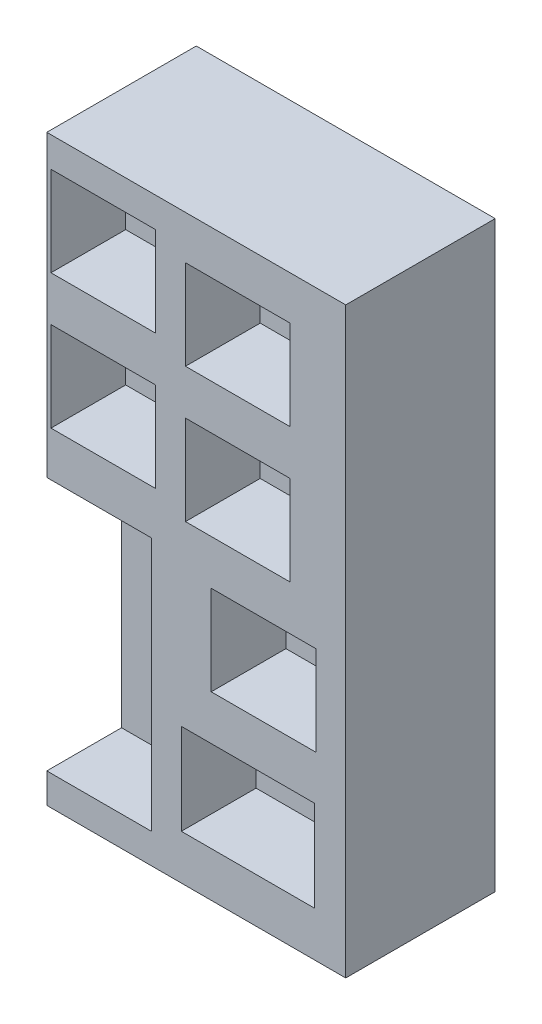
ISO-10303-21;
HEADER;
FILE_DESCRIPTION(('STEP AP214'),'2;1');
FILE_NAME('part.step','',(''),(''),'','','');
FILE_SCHEMA(('AUTOMOTIVE_DESIGN { 1 0 10303 214 1 1 1 1 }'));
ENDSEC;
DATA;
#1=APPLICATION_CONTEXT('core data for automotive mechanical design processes');
#2=APPLICATION_PROTOCOL_DEFINITION('international standard','automotive_design',2000,#1);
#3=PRODUCT_CONTEXT('',#1,'mechanical');
#4=PRODUCT('Part','Part','',(#3));
#5=PRODUCT_RELATED_PRODUCT_CATEGORY('part','',(#4));
#6=PRODUCT_DEFINITION_FORMATION('','',#4);
#7=PRODUCT_DEFINITION_CONTEXT('part definition',#1,'design');
#8=PRODUCT_DEFINITION('design','',#6,#7);
#9=PRODUCT_DEFINITION_SHAPE('','',#8);
#10=(LENGTH_UNIT() NAMED_UNIT(*) SI_UNIT(.MILLI.,.METRE.));
#11=(NAMED_UNIT(*) PLANE_ANGLE_UNIT() SI_UNIT($,.RADIAN.));
#12=(NAMED_UNIT(*) SI_UNIT($,.STERADIAN.) SOLID_ANGLE_UNIT());
#13=UNCERTAINTY_MEASURE_WITH_UNIT(LENGTH_MEASURE(1.E-05),#10,'distance_accuracy_value','');
#14=(GEOMETRIC_REPRESENTATION_CONTEXT(3) GLOBAL_UNCERTAINTY_ASSIGNED_CONTEXT((#13)) GLOBAL_UNIT_ASSIGNED_CONTEXT((#10,
#11,#12)) REPRESENTATION_CONTEXT('',''));
#15=CARTESIAN_POINT('',(0.,0.,0.));
#16=DIRECTION('',(0.,0.,1.));
#17=DIRECTION('',(1.,0.,0.));
#18=AXIS2_PLACEMENT_3D('',#15,#16,#17);
#19=CARTESIAN_POINT('',(-27.8641048999657,26.3351313694196,12.7));
#20=DIRECTION('',(1.,0.,0.));
#21=DIRECTION('',(0.,1.,0.));
#22=AXIS2_PLACEMENT_3D('',#19,#20,#21);
#23=PLANE('',#22);
#24=DIRECTION('',(0.,-1.,0.));
#25=VECTOR('',#24,1.);
#26=CARTESIAN_POINT('',(-27.8641048999657,0.935131369419626,6.35));
#27=LINE('',#26,#25);
#28=CARTESIAN_POINT('',(-27.8641048999657,0.935131369419626,6.35));
#29=VERTEX_POINT('',#28);
#30=CARTESIAN_POINT('',(-27.8641048999657,-20.6548686305804,6.35));
#31=VERTEX_POINT('',#30);
#32=EDGE_CURVE('E438',#29,#31,#27,.T.);
#33=ORIENTED_EDGE('',*,*,#32,.F.);
#34=DIRECTION('',(0.,0.,1.));
#35=VECTOR('',#34,1.);
#36=CARTESIAN_POINT('',(-27.8641048999657,0.935131369419626,6.35));
#37=LINE('',#36,#35);
#38=CARTESIAN_POINT('',(-27.8641048999657,0.935131369419626,12.7));
#39=VERTEX_POINT('',#38);
#40=EDGE_CURVE('E458',#29,#39,#37,.T.);
#41=ORIENTED_EDGE('',*,*,#40,.T.);
#42=DIRECTION('',(0.,-1.,0.));
#43=VECTOR('',#42,1.);
#44=CARTESIAN_POINT('',(-27.8641048999657,26.3351313694196,12.7));
#45=LINE('',#44,#43);
#46=CARTESIAN_POINT('',(-27.8641048999657,26.3351313694196,12.7));
#47=VERTEX_POINT('',#46);
#48=EDGE_CURVE('E467',#47,#39,#45,.T.);
#49=ORIENTED_EDGE('',*,*,#48,.F.);
#50=DIRECTION('',(0.,0.,-1.));
#51=VECTOR('',#50,1.);
#52=CARTESIAN_POINT('',(-27.8641048999657,26.3351313694196,12.7));
#53=LINE('',#52,#51);
#54=CARTESIAN_POINT('',(-27.8641048999657,26.3351313694196,0.));
#55=VERTEX_POINT('',#54);
#56=EDGE_CURVE('E477',#47,#55,#53,.T.);
#57=ORIENTED_EDGE('',*,*,#56,.T.);
#58=DIRECTION('',(0.,-1.,0.));
#59=VECTOR('',#58,1.);
#60=CARTESIAN_POINT('',(-27.8641048999657,26.3351313694196,0.));
#61=LINE('',#60,#59);
#62=CARTESIAN_POINT('',(-27.8641048999657,-23.1948686305804,0.));
#63=VERTEX_POINT('',#62);
#64=EDGE_CURVE('E461',#55,#63,#61,.T.);
#65=ORIENTED_EDGE('',*,*,#64,.T.);
#66=DIRECTION('',(0.,0.,-1.));
#67=VECTOR('',#66,1.);
#68=CARTESIAN_POINT('',(-27.8641048999657,-23.1948686305804,12.7));
#69=LINE('',#68,#67);
#70=CARTESIAN_POINT('',(-27.8641048999657,-23.1948686305804,12.7));
#71=VERTEX_POINT('',#70);
#72=EDGE_CURVE('E11',#71,#63,#69,.T.);
#73=ORIENTED_EDGE('',*,*,#72,.F.);
#74=CARTESIAN_POINT('',(-27.8641048999657,-20.6548686305804,12.7));
#75=VERTEX_POINT('',#74);
#76=EDGE_CURVE('E471',#75,#71,#45,.T.);
#77=ORIENTED_EDGE('',*,*,#76,.F.);
#78=DIRECTION('',(0.,0.,1.));
#79=VECTOR('',#78,1.);
#80=CARTESIAN_POINT('',(-27.8641048999657,-20.6548686305804,6.35));
#81=LINE('',#80,#79);
#82=EDGE_CURVE('E451',#31,#75,#81,.T.);
#83=ORIENTED_EDGE('',*,*,#82,.F.);
#84=EDGE_LOOP('',(#33,#41,#49,#57,#65,#73,#77,#83));
#85=FACE_BOUND('',#84,.T.);
#86=ADVANCED_FACE('F33',(#85),#23,.F.);
#87=CARTESIAN_POINT('',(-27.8641048999657,-23.1948686305804,12.7));
#88=DIRECTION('',(0.,1.,0.));
#89=DIRECTION('',(0.,0.,1.));
#90=AXIS2_PLACEMENT_3D('',#87,#88,#89);
#91=PLANE('',#90);
#92=DIRECTION('',(1.,0.,0.));
#93=VECTOR('',#92,1.);
#94=CARTESIAN_POINT('',(-27.8641048999657,-23.1948686305804,0.));
#95=LINE('',#94,#93);
#96=CARTESIAN_POINT('',(-2.46410489996568,-23.1948686305804,0.));
#97=VERTEX_POINT('',#96);
#98=EDGE_CURVE('E480',#63,#97,#95,.T.);
#99=ORIENTED_EDGE('',*,*,#98,.T.);
#100=DIRECTION('',(0.,0.,-1.));
#101=VECTOR('',#100,1.);
#102=CARTESIAN_POINT('',(-2.46410489996568,-23.1948686305804,12.7));
#103=LINE('',#102,#101);
#104=CARTESIAN_POINT('',(-2.46410489996568,-23.1948686305804,12.7));
#105=VERTEX_POINT('',#104);
#106=EDGE_CURVE('E40',#105,#97,#103,.T.);
#107=ORIENTED_EDGE('',*,*,#106,.F.);
#108=DIRECTION('',(1.,0.,0.));
#109=VECTOR('',#108,1.);
#110=CARTESIAN_POINT('',(-27.8641048999657,-23.1948686305804,12.7));
#111=LINE('',#110,#109);
#112=EDGE_CURVE('E470',#71,#105,#111,.T.);
#113=ORIENTED_EDGE('',*,*,#112,.F.);
#114=ORIENTED_EDGE('',*,*,#72,.T.);
#115=EDGE_LOOP('',(#99,#107,#113,#114));
#116=FACE_BOUND('',#115,.T.);
#117=ADVANCED_FACE('F517',(#116),#91,.F.);
#118=CARTESIAN_POINT('',(-2.46410489996569,26.3351313694196,12.7));
#119=DIRECTION('',(-1.,0.,0.));
#120=DIRECTION('',(0.,-1.,0.));
#121=AXIS2_PLACEMENT_3D('',#118,#119,#120);
#122=PLANE('',#121);
#123=DIRECTION('',(0.,1.,0.));
#124=VECTOR('',#123,1.);
#125=CARTESIAN_POINT('',(-2.46410489996569,26.3351313694196,0.));
#126=LINE('',#125,#124);
#127=CARTESIAN_POINT('',(-2.46410489996569,26.3351313694196,0.));
#128=VERTEX_POINT('',#127);
#129=EDGE_CURVE('E482',#97,#128,#126,.T.);
#130=ORIENTED_EDGE('',*,*,#129,.T.);
#131=DIRECTION('',(0.,0.,-1.));
#132=VECTOR('',#131,1.);
#133=CARTESIAN_POINT('',(-2.46410489996569,26.3351313694196,12.7));
#134=LINE('',#133,#132);
#135=CARTESIAN_POINT('',(-2.46410489996569,26.3351313694196,12.7));
#136=VERTEX_POINT('',#135);
#137=EDGE_CURVE('E488',#136,#128,#134,.T.);
#138=ORIENTED_EDGE('',*,*,#137,.F.);
#139=DIRECTION('',(0.,1.,0.));
#140=VECTOR('',#139,1.);
#141=CARTESIAN_POINT('',(-2.46410489996569,26.3351313694196,12.7));
#142=LINE('',#141,#140);
#143=EDGE_CURVE('E473',#105,#136,#142,.T.);
#144=ORIENTED_EDGE('',*,*,#143,.F.);
#145=ORIENTED_EDGE('',*,*,#106,.T.);
#146=EDGE_LOOP('',(#130,#138,#144,#145));
#147=FACE_BOUND('',#146,.T.);
#148=ADVANCED_FACE('F495',(#147),#122,.F.);
#149=CARTESIAN_POINT('',(-27.8641048999657,26.3351313694196,12.7));
#150=DIRECTION('',(0.,-1.,0.));
#151=DIRECTION('',(0.,0.,-1.));
#152=AXIS2_PLACEMENT_3D('',#149,#150,#151);
#153=PLANE('',#152);
#154=DIRECTION('',(-1.,0.,0.));
#155=VECTOR('',#154,1.);
#156=CARTESIAN_POINT('',(-27.8641048999657,26.3351313694196,0.));
#157=LINE('',#156,#155);
#158=EDGE_CURVE('E484',#128,#55,#157,.T.);
#159=ORIENTED_EDGE('',*,*,#158,.T.);
#160=ORIENTED_EDGE('',*,*,#56,.F.);
#161=DIRECTION('',(-1.,0.,0.));
#162=VECTOR('',#161,1.);
#163=CARTESIAN_POINT('',(-27.8641048999657,26.3351313694196,12.7));
#164=LINE('',#163,#162);
#165=EDGE_CURVE('E475',#136,#47,#164,.T.);
#166=ORIENTED_EDGE('',*,*,#165,.F.);
#167=ORIENTED_EDGE('',*,*,#137,.T.);
#168=EDGE_LOOP('',(#159,#160,#166,#167));
#169=FACE_BOUND('',#168,.T.);
#170=ADVANCED_FACE('F505',(#169),#153,.F.);
#171=CARTESIAN_POINT('',(0.,0.,12.7));
#172=DIRECTION('',(0.,0.,1.));
#173=DIRECTION('',(1.,0.,0.));
#174=AXIS2_PLACEMENT_3D('',#171,#172,#173);
#175=PLANE('',#174);
#176=DIRECTION('',(0.,-1.,0.));
#177=VECTOR('',#176,1.);
#178=CARTESIAN_POINT('',(-16.0812671962141,22.6299261814196,12.7));
#179=LINE('',#178,#177);
#180=CARTESIAN_POINT('',(-16.0812671962141,22.6299261814196,12.7));
#181=VERTEX_POINT('',#180);
#182=CARTESIAN_POINT('',(-16.0812671962141,15.0099261814196,12.7));
#183=VERTEX_POINT('',#182);
#184=EDGE_CURVE('E47',#181,#183,#179,.T.);
#185=ORIENTED_EDGE('',*,*,#184,.F.);
#186=DIRECTION('',(-1.,0.,0.));
#187=VECTOR('',#186,1.);
#188=CARTESIAN_POINT('',(-16.0812671962141,22.6299261814196,12.7));
#189=LINE('',#188,#187);
#190=CARTESIAN_POINT('',(-7.19126719621413,22.6299261814196,12.7));
#191=VERTEX_POINT('',#190);
#192=EDGE_CURVE('E261',#191,#181,#189,.T.);
#193=ORIENTED_EDGE('',*,*,#192,.F.);
#194=DIRECTION('',(0.,1.,0.));
#195=VECTOR('',#194,1.);
#196=CARTESIAN_POINT('',(-7.19126719621413,22.6299261814196,12.7));
#197=LINE('',#196,#195);
#198=CARTESIAN_POINT('',(-7.19126719621412,15.0099261814196,12.7));
#199=VERTEX_POINT('',#198);
#200=EDGE_CURVE('E264',#199,#191,#197,.T.);
#201=ORIENTED_EDGE('',*,*,#200,.F.);
#202=DIRECTION('',(1.,0.,0.));
#203=VECTOR('',#202,1.);
#204=CARTESIAN_POINT('',(-16.0812671962141,15.0099261814196,12.7));
#205=LINE('',#204,#203);
#206=EDGE_CURVE('E270',#183,#199,#205,.T.);
#207=ORIENTED_EDGE('',*,*,#206,.F.);
#208=EDGE_LOOP('',(#185,#193,#201,#207));
#209=FACE_BOUND('',#208,.T.);
#210=DIRECTION('',(0.,-1.,0.));
#211=VECTOR('',#210,1.);
#212=CARTESIAN_POINT('',(-27.5112671962141,16.1751313694196,12.7));
#213=LINE('',#212,#211);
#214=CARTESIAN_POINT('',(-27.5112671962141,23.7951313694196,12.7));
#215=VERTEX_POINT('',#214);
#216=CARTESIAN_POINT('',(-27.5112671962141,16.1751313694196,12.7));
#217=VERTEX_POINT('',#216);
#218=EDGE_CURVE('E55',#215,#217,#213,.T.);
#219=ORIENTED_EDGE('',*,*,#218,.F.);
#220=DIRECTION('',(-1.,0.,0.));
#221=VECTOR('',#220,1.);
#222=CARTESIAN_POINT('',(-27.5112671962141,23.7951313694196,12.7));
#223=LINE('',#222,#221);
#224=CARTESIAN_POINT('',(-18.6212671962141,23.7951313694196,12.7));
#225=VERTEX_POINT('',#224);
#226=EDGE_CURVE('E283',#225,#215,#223,.T.);
#227=ORIENTED_EDGE('',*,*,#226,.F.);
#228=DIRECTION('',(0.,1.,0.));
#229=VECTOR('',#228,1.);
#230=CARTESIAN_POINT('',(-18.6212671962141,16.1751313694196,12.7));
#231=LINE('',#230,#229);
#232=CARTESIAN_POINT('',(-18.6212671962141,16.1751313694196,12.7));
#233=VERTEX_POINT('',#232);
#234=EDGE_CURVE('E297',#233,#225,#231,.T.);
#235=ORIENTED_EDGE('',*,*,#234,.F.);
#236=DIRECTION('',(1.,0.,0.));
#237=VECTOR('',#236,1.);
#238=CARTESIAN_POINT('',(-27.5112671962141,16.1751313694196,12.7));
#239=LINE('',#238,#237);
#240=EDGE_CURVE('E294',#217,#233,#239,.T.);
#241=ORIENTED_EDGE('',*,*,#240,.F.);
#242=EDGE_LOOP('',(#219,#227,#235,#241));
#243=FACE_BOUND('',#242,.T.);
#244=DIRECTION('',(0.,-1.,0.));
#245=VECTOR('',#244,1.);
#246=CARTESIAN_POINT('',(-16.0812671962141,3.57992618141962,12.7));
#247=LINE('',#246,#245);
#248=CARTESIAN_POINT('',(-16.0812671962141,11.1999261814196,12.7));
#249=VERTEX_POINT('',#248);
#250=CARTESIAN_POINT('',(-16.0812671962141,3.57992618141962,12.7));
#251=VERTEX_POINT('',#250);
#252=EDGE_CURVE('E304',#249,#251,#247,.T.);
#253=ORIENTED_EDGE('',*,*,#252,.F.);
#254=DIRECTION('',(-1.,0.,0.));
#255=VECTOR('',#254,1.);
#256=CARTESIAN_POINT('',(-16.0812671962141,11.1999261814196,12.7));
#257=LINE('',#256,#255);
#258=CARTESIAN_POINT('',(-7.19126719621413,11.1999261814196,12.7));
#259=VERTEX_POINT('',#258);
#260=EDGE_CURVE('E314',#259,#249,#257,.T.);
#261=ORIENTED_EDGE('',*,*,#260,.F.);
#262=DIRECTION('',(0.,1.,0.));
#263=VECTOR('',#262,1.);
#264=CARTESIAN_POINT('',(-7.19126719621413,3.57992618141962,12.7));
#265=LINE('',#264,#263);
#266=CARTESIAN_POINT('',(-7.19126719621413,3.57992618141962,12.7));
#267=VERTEX_POINT('',#266);
#268=EDGE_CURVE('E328',#267,#259,#265,.T.);
#269=ORIENTED_EDGE('',*,*,#268,.F.);
#270=DIRECTION('',(1.,0.,0.));
#271=VECTOR('',#270,1.);
#272=CARTESIAN_POINT('',(-16.0812671962141,3.57992618141962,12.7));
#273=LINE('',#272,#271);
#274=EDGE_CURVE('E325',#251,#267,#273,.T.);
#275=ORIENTED_EDGE('',*,*,#274,.F.);
#276=EDGE_LOOP('',(#253,#261,#269,#275));
#277=FACE_BOUND('',#276,.T.);
#278=DIRECTION('',(0.,-1.,0.));
#279=VECTOR('',#278,1.);
#280=CARTESIAN_POINT('',(-27.5112671962141,4.74513136941962,12.7));
#281=LINE('',#280,#279);
#282=CARTESIAN_POINT('',(-27.5112671962141,12.3651313694196,12.7));
#283=VERTEX_POINT('',#282);
#284=CARTESIAN_POINT('',(-27.5112671962141,4.74513136941962,12.7));
#285=VERTEX_POINT('',#284);
#286=EDGE_CURVE('E335',#283,#285,#281,.T.);
#287=ORIENTED_EDGE('',*,*,#286,.F.);
#288=DIRECTION('',(-1.,0.,0.));
#289=VECTOR('',#288,1.);
#290=CARTESIAN_POINT('',(-27.5112671962141,12.3651313694196,12.7));
#291=LINE('',#290,#289);
#292=CARTESIAN_POINT('',(-18.6212671962141,12.3651313694196,12.7));
#293=VERTEX_POINT('',#292);
#294=EDGE_CURVE('E346',#293,#283,#291,.T.);
#295=ORIENTED_EDGE('',*,*,#294,.F.);
#296=DIRECTION('',(0.,1.,0.));
#297=VECTOR('',#296,1.);
#298=CARTESIAN_POINT('',(-18.6212671962141,4.74513136941962,12.7));
#299=LINE('',#298,#297);
#300=CARTESIAN_POINT('',(-18.6212671962141,4.74513136941962,12.7));
#301=VERTEX_POINT('',#300);
#302=EDGE_CURVE('E360',#301,#293,#299,.T.);
#303=ORIENTED_EDGE('',*,*,#302,.F.);
#304=DIRECTION('',(1.,0.,0.));
#305=VECTOR('',#304,1.);
#306=CARTESIAN_POINT('',(-27.5112671962141,4.74513136941962,12.7));
#307=LINE('',#306,#305);
#308=EDGE_CURVE('E357',#285,#301,#307,.T.);
#309=ORIENTED_EDGE('',*,*,#308,.F.);
#310=EDGE_LOOP('',(#287,#295,#303,#309));
#311=FACE_BOUND('',#310,.T.);
#312=DIRECTION('',(0.,-1.,0.));
#313=VECTOR('',#312,1.);
#314=CARTESIAN_POINT('',(-13.8941048999657,-7.85007381858038,12.7));
#315=LINE('',#314,#313);
#316=CARTESIAN_POINT('',(-13.8941048999657,-0.230073818580377,12.7));
#317=VERTEX_POINT('',#316);
#318=CARTESIAN_POINT('',(-13.8941048999657,-7.85007381858038,12.7));
#319=VERTEX_POINT('',#318);
#320=EDGE_CURVE('E367',#317,#319,#315,.T.);
#321=ORIENTED_EDGE('',*,*,#320,.F.);
#322=DIRECTION('',(-1.,0.,0.));
#323=VECTOR('',#322,1.);
#324=CARTESIAN_POINT('',(-13.8941048999657,-0.230073818580377,12.7));
#325=LINE('',#324,#323);
#326=CARTESIAN_POINT('',(-5.00410489996568,-0.230073818580377,12.7));
#327=VERTEX_POINT('',#326);
#328=EDGE_CURVE('E378',#327,#317,#325,.T.);
#329=ORIENTED_EDGE('',*,*,#328,.F.);
#330=DIRECTION('',(0.,1.,0.));
#331=VECTOR('',#330,1.);
#332=CARTESIAN_POINT('',(-5.00410489996568,-7.85007381858038,12.7));
#333=LINE('',#332,#331);
#334=CARTESIAN_POINT('',(-5.00410489996568,-7.85007381858038,12.7));
#335=VERTEX_POINT('',#334);
#336=EDGE_CURVE('E392',#335,#327,#333,.T.);
#337=ORIENTED_EDGE('',*,*,#336,.F.);
#338=DIRECTION('',(1.,0.,0.));
#339=VECTOR('',#338,1.);
#340=CARTESIAN_POINT('',(-13.8941048999657,-7.85007381858038,12.7));
#341=LINE('',#340,#339);
#342=EDGE_CURVE('E389',#319,#335,#341,.T.);
#343=ORIENTED_EDGE('',*,*,#342,.F.);
#344=EDGE_LOOP('',(#321,#329,#337,#343));
#345=FACE_BOUND('',#344,.T.);
#346=DIRECTION('',(0.,-1.,0.));
#347=VECTOR('',#346,1.);
#348=CARTESIAN_POINT('',(-16.4341048999657,-19.3848686305804,12.7));
#349=LINE('',#348,#347);
#350=CARTESIAN_POINT('',(-16.4341048999657,-11.6600738185804,12.7));
#351=VERTEX_POINT('',#350);
#352=CARTESIAN_POINT('',(-16.4341048999657,-19.3848686305804,12.7));
#353=VERTEX_POINT('',#352);
#354=EDGE_CURVE('E399',#351,#353,#349,.T.);
#355=ORIENTED_EDGE('',*,*,#354,.F.);
#356=DIRECTION('',(-1.,0.,0.));
#357=VECTOR('',#356,1.);
#358=CARTESIAN_POINT('',(-16.4341048999657,-11.6600738185804,12.7));
#359=LINE('',#358,#357);
#360=CARTESIAN_POINT('',(-5.10990402796568,-11.6600738185804,12.7));
#361=VERTEX_POINT('',#360);
#362=EDGE_CURVE('E410',#361,#351,#359,.T.);
#363=ORIENTED_EDGE('',*,*,#362,.F.);
#364=DIRECTION('',(0.,1.,0.));
#365=VECTOR('',#364,1.);
#366=CARTESIAN_POINT('',(-5.10990402796568,-19.3848686305804,12.7));
#367=LINE('',#366,#365);
#368=CARTESIAN_POINT('',(-5.10990402796568,-19.3848686305804,12.7));
#369=VERTEX_POINT('',#368);
#370=EDGE_CURVE('E424',#369,#361,#367,.T.);
#371=ORIENTED_EDGE('',*,*,#370,.F.);
#372=DIRECTION('',(1.,0.,0.));
#373=VECTOR('',#372,1.);
#374=CARTESIAN_POINT('',(-16.4341048999657,-19.3848686305804,12.7));
#375=LINE('',#374,#373);
#376=EDGE_CURVE('E421',#353,#369,#375,.T.);
#377=ORIENTED_EDGE('',*,*,#376,.F.);
#378=EDGE_LOOP('',(#355,#363,#371,#377));
#379=FACE_BOUND('',#378,.T.);
#380=DIRECTION('',(-1.,0.,0.));
#381=VECTOR('',#380,1.);
#382=CARTESIAN_POINT('',(-27.8641048999657,0.935131369419626,12.7));
#383=LINE('',#382,#381);
#384=CARTESIAN_POINT('',(-18.9741048999657,0.935131369419626,12.7));
#385=VERTEX_POINT('',#384);
#386=EDGE_CURVE('E442',#385,#39,#383,.T.);
#387=ORIENTED_EDGE('',*,*,#386,.F.);
#388=DIRECTION('',(0.,1.,0.));
#389=VECTOR('',#388,1.);
#390=CARTESIAN_POINT('',(-18.9741048999657,0.935131369419626,12.7));
#391=LINE('',#390,#389);
#392=CARTESIAN_POINT('',(-18.9741048999657,-20.6548686305804,12.7));
#393=VERTEX_POINT('',#392);
#394=EDGE_CURVE('E454',#393,#385,#391,.T.);
#395=ORIENTED_EDGE('',*,*,#394,.F.);
#396=DIRECTION('',(1.,0.,0.));
#397=VECTOR('',#396,1.);
#398=CARTESIAN_POINT('',(-27.8641048999657,-20.6548686305804,12.7));
#399=LINE('',#398,#397);
#400=EDGE_CURVE('E431',#75,#393,#399,.T.);
#401=ORIENTED_EDGE('',*,*,#400,.F.);
#402=ORIENTED_EDGE('',*,*,#76,.T.);
#403=ORIENTED_EDGE('',*,*,#112,.T.);
#404=ORIENTED_EDGE('',*,*,#143,.T.);
#405=ORIENTED_EDGE('',*,*,#165,.T.);
#406=ORIENTED_EDGE('',*,*,#48,.T.);
#407=EDGE_LOOP('',(#387,#395,#401,#402,#403,#404,#405,#406));
#408=FACE_BOUND('',#407,.T.);
#409=ADVANCED_FACE('F513',(#209,#243,#277,#311,#345,#379,#408),#175,.T.);
#410=CARTESIAN_POINT('',(0.,0.,0.));
#411=DIRECTION('',(0.,0.,1.));
#412=DIRECTION('',(1.,0.,0.));
#413=AXIS2_PLACEMENT_3D('',#410,#411,#412);
#414=PLANE('',#413);
#415=ORIENTED_EDGE('',*,*,#64,.F.);
#416=ORIENTED_EDGE('',*,*,#158,.F.);
#417=ORIENTED_EDGE('',*,*,#129,.F.);
#418=ORIENTED_EDGE('',*,*,#98,.F.);
#419=EDGE_LOOP('',(#415,#416,#417,#418));
#420=FACE_BOUND('',#419,.T.);
#421=ADVANCED_FACE('F502',(#420),#414,.F.);
#422=CARTESIAN_POINT('',(-27.8641048999657,0.935131369419626,6.35));
#423=DIRECTION('',(0.,1.,0.));
#424=DIRECTION('',(0.,0.,1.));
#425=AXIS2_PLACEMENT_3D('',#422,#423,#424);
#426=PLANE('',#425);
#427=ORIENTED_EDGE('',*,*,#386,.T.);
#428=ORIENTED_EDGE('',*,*,#40,.F.);
#429=DIRECTION('',(-1.,0.,0.));
#430=VECTOR('',#429,1.);
#431=CARTESIAN_POINT('',(-27.8641048999657,0.935131369419626,6.35));
#432=LINE('',#431,#430);
#433=CARTESIAN_POINT('',(-18.9741048999657,0.935131369419626,6.35));
#434=VERTEX_POINT('',#433);
#435=EDGE_CURVE('E448',#434,#29,#432,.T.);
#436=ORIENTED_EDGE('',*,*,#435,.F.);
#437=DIRECTION('',(0.,0.,1.));
#438=VECTOR('',#437,1.);
#439=CARTESIAN_POINT('',(-18.9741048999657,0.935131369419626,6.35));
#440=LINE('',#439,#438);
#441=EDGE_CURVE('E462',#434,#385,#440,.T.);
#442=ORIENTED_EDGE('',*,*,#441,.T.);
#443=EDGE_LOOP('',(#427,#428,#436,#442));
#444=FACE_BOUND('',#443,.T.);
#445=ADVANCED_FACE('F528',(#444),#426,.F.);
#446=CARTESIAN_POINT('',(-18.9741048999657,0.935131369419626,6.35));
#447=DIRECTION('',(1.,0.,0.));
#448=DIRECTION('',(0.,0.,-1.));
#449=AXIS2_PLACEMENT_3D('',#446,#447,#448);
#450=PLANE('',#449);
#451=ORIENTED_EDGE('',*,*,#394,.T.);
#452=ORIENTED_EDGE('',*,*,#441,.F.);
#453=DIRECTION('',(0.,1.,0.));
#454=VECTOR('',#453,1.);
#455=CARTESIAN_POINT('',(-18.9741048999657,0.935131369419626,6.35));
#456=LINE('',#455,#454);
#457=CARTESIAN_POINT('',(-18.9741048999657,-20.6548686305804,6.35));
#458=VERTEX_POINT('',#457);
#459=EDGE_CURVE('E445',#458,#434,#456,.T.);
#460=ORIENTED_EDGE('',*,*,#459,.F.);
#461=DIRECTION('',(0.,0.,1.));
#462=VECTOR('',#461,1.);
#463=CARTESIAN_POINT('',(-18.9741048999657,-20.6548686305804,6.35));
#464=LINE('',#463,#462);
#465=EDGE_CURVE('E464',#458,#393,#464,.T.);
#466=ORIENTED_EDGE('',*,*,#465,.T.);
#467=EDGE_LOOP('',(#451,#452,#460,#466));
#468=FACE_BOUND('',#467,.T.);
#469=ADVANCED_FACE('F522',(#468),#450,.F.);
#470=CARTESIAN_POINT('',(-27.8641048999657,-20.6548686305804,6.35));
#471=DIRECTION('',(0.,-1.,0.));
#472=DIRECTION('',(1.,0.,0.));
#473=AXIS2_PLACEMENT_3D('',#470,#471,#472);
#474=PLANE('',#473);
#475=ORIENTED_EDGE('',*,*,#400,.T.);
#476=ORIENTED_EDGE('',*,*,#465,.F.);
#477=DIRECTION('',(1.,0.,0.));
#478=VECTOR('',#477,1.);
#479=CARTESIAN_POINT('',(-27.8641048999657,-20.6548686305804,6.35));
#480=LINE('',#479,#478);
#481=EDGE_CURVE('E441',#31,#458,#480,.T.);
#482=ORIENTED_EDGE('',*,*,#481,.F.);
#483=ORIENTED_EDGE('',*,*,#82,.T.);
#484=EDGE_LOOP('',(#475,#476,#482,#483));
#485=FACE_BOUND('',#484,.T.);
#486=ADVANCED_FACE('F520',(#485),#474,.F.);
#487=CARTESIAN_POINT('',(0.,0.,6.35));
#488=DIRECTION('',(0.,0.,1.));
#489=DIRECTION('',(1.,0.,0.));
#490=AXIS2_PLACEMENT_3D('',#487,#488,#489);
#491=PLANE('',#490);
#492=ORIENTED_EDGE('',*,*,#32,.T.);
#493=ORIENTED_EDGE('',*,*,#481,.T.);
#494=ORIENTED_EDGE('',*,*,#459,.T.);
#495=ORIENTED_EDGE('',*,*,#435,.T.);
#496=EDGE_LOOP('',(#492,#493,#494,#495));
#497=FACE_BOUND('',#496,.T.);
#498=ADVANCED_FACE('F526',(#497),#491,.T.);
#499=CARTESIAN_POINT('',(-16.4341048999657,-19.3848686305804,6.35));
#500=DIRECTION('',(-1.,0.,0.));
#501=DIRECTION('',(0.,0.,1.));
#502=AXIS2_PLACEMENT_3D('',#499,#500,#501);
#503=PLANE('',#502);
#504=ORIENTED_EDGE('',*,*,#354,.T.);
#505=DIRECTION('',(0.,0.,1.));
#506=VECTOR('',#505,1.);
#507=CARTESIAN_POINT('',(-16.4341048999657,-19.3848686305804,6.35));
#508=LINE('',#507,#506);
#509=CARTESIAN_POINT('',(-16.4341048999657,-19.3848686305804,6.35));
#510=VERTEX_POINT('',#509);
#511=EDGE_CURVE('E419',#510,#353,#508,.T.);
#512=ORIENTED_EDGE('',*,*,#511,.F.);
#513=DIRECTION('',(0.,-1.,0.));
#514=VECTOR('',#513,1.);
#515=CARTESIAN_POINT('',(-16.4341048999657,-19.3848686305804,6.35));
#516=LINE('',#515,#514);
#517=CARTESIAN_POINT('',(-16.4341048999657,-11.6600738185804,6.35));
#518=VERTEX_POINT('',#517);
#519=EDGE_CURVE('E406',#518,#510,#516,.T.);
#520=ORIENTED_EDGE('',*,*,#519,.F.);
#521=DIRECTION('',(0.,0.,1.));
#522=VECTOR('',#521,1.);
#523=CARTESIAN_POINT('',(-16.4341048999657,-11.6600738185804,6.35));
#524=LINE('',#523,#522);
#525=EDGE_CURVE('E429',#518,#351,#524,.T.);
#526=ORIENTED_EDGE('',*,*,#525,.T.);
#527=EDGE_LOOP('',(#504,#512,#520,#526));
#528=FACE_BOUND('',#527,.T.);
#529=ADVANCED_FACE('F556',(#528),#503,.F.);
#530=CARTESIAN_POINT('',(-16.4341048999657,-11.6600738185804,6.35));
#531=DIRECTION('',(0.,1.,0.));
#532=DIRECTION('',(0.,0.,1.));
#533=AXIS2_PLACEMENT_3D('',#530,#531,#532);
#534=PLANE('',#533);
#535=ORIENTED_EDGE('',*,*,#362,.T.);
#536=ORIENTED_EDGE('',*,*,#525,.F.);
#537=DIRECTION('',(-1.,0.,0.));
#538=VECTOR('',#537,1.);
#539=CARTESIAN_POINT('',(-16.4341048999657,-11.6600738185804,6.35));
#540=LINE('',#539,#538);
#541=CARTESIAN_POINT('',(-5.10990402796568,-11.6600738185804,6.35));
#542=VERTEX_POINT('',#541);
#543=EDGE_CURVE('E416',#542,#518,#540,.T.);
#544=ORIENTED_EDGE('',*,*,#543,.F.);
#545=DIRECTION('',(0.,0.,1.));
#546=VECTOR('',#545,1.);
#547=CARTESIAN_POINT('',(-5.10990402796568,-11.6600738185804,6.35));
#548=LINE('',#547,#546);
#549=EDGE_CURVE('E432',#542,#361,#548,.T.);
#550=ORIENTED_EDGE('',*,*,#549,.T.);
#551=EDGE_LOOP('',(#535,#536,#544,#550));
#552=FACE_BOUND('',#551,.T.);
#553=ADVANCED_FACE('F560',(#552),#534,.F.);
#554=CARTESIAN_POINT('',(-5.10990402796568,-19.3848686305804,6.35));
#555=DIRECTION('',(1.,0.,0.));
#556=DIRECTION('',(0.,0.,-1.));
#557=AXIS2_PLACEMENT_3D('',#554,#555,#556);
#558=PLANE('',#557);
#559=ORIENTED_EDGE('',*,*,#370,.T.);
#560=ORIENTED_EDGE('',*,*,#549,.F.);
#561=DIRECTION('',(0.,1.,0.));
#562=VECTOR('',#561,1.);
#563=CARTESIAN_POINT('',(-5.10990402796568,-19.3848686305804,6.35));
#564=LINE('',#563,#562);
#565=CARTESIAN_POINT('',(-5.10990402796568,-19.3848686305804,6.35));
#566=VERTEX_POINT('',#565);
#567=EDGE_CURVE('E413',#566,#542,#564,.T.);
#568=ORIENTED_EDGE('',*,*,#567,.F.);
#569=DIRECTION('',(0.,0.,1.));
#570=VECTOR('',#569,1.);
#571=CARTESIAN_POINT('',(-5.10990402796568,-19.3848686305804,6.35));
#572=LINE('',#571,#570);
#573=EDGE_CURVE('E434',#566,#369,#572,.T.);
#574=ORIENTED_EDGE('',*,*,#573,.T.);
#575=EDGE_LOOP('',(#559,#560,#568,#574));
#576=FACE_BOUND('',#575,.T.);
#577=ADVANCED_FACE('F568',(#576),#558,.F.);
#578=CARTESIAN_POINT('',(-16.4341048999657,-19.3848686305804,6.35));
#579=DIRECTION('',(0.,-1.,0.));
#580=DIRECTION('',(0.,0.,-1.));
#581=AXIS2_PLACEMENT_3D('',#578,#579,#580);
#582=PLANE('',#581);
#583=ORIENTED_EDGE('',*,*,#376,.T.);
#584=ORIENTED_EDGE('',*,*,#573,.F.);
#585=DIRECTION('',(1.,0.,0.));
#586=VECTOR('',#585,1.);
#587=CARTESIAN_POINT('',(-16.4341048999657,-19.3848686305804,6.35));
#588=LINE('',#587,#586);
#589=EDGE_CURVE('E409',#510,#566,#588,.T.);
#590=ORIENTED_EDGE('',*,*,#589,.F.);
#591=ORIENTED_EDGE('',*,*,#511,.T.);
#592=EDGE_LOOP('',(#583,#584,#590,#591));
#593=FACE_BOUND('',#592,.T.);
#594=ADVANCED_FACE('F564',(#593),#582,.F.);
#595=CARTESIAN_POINT('',(0.,0.,6.35));
#596=DIRECTION('',(0.,0.,-1.));
#597=DIRECTION('',(-1.,0.,0.));
#598=AXIS2_PLACEMENT_3D('',#595,#596,#597);
#599=PLANE('',#598);
#600=ORIENTED_EDGE('',*,*,#519,.T.);
#601=ORIENTED_EDGE('',*,*,#589,.T.);
#602=ORIENTED_EDGE('',*,*,#567,.T.);
#603=ORIENTED_EDGE('',*,*,#543,.T.);
#604=EDGE_LOOP('',(#600,#601,#602,#603));
#605=FACE_BOUND('',#604,.T.);
#606=ADVANCED_FACE('F567',(#605),#599,.F.);
#607=CARTESIAN_POINT('',(-13.8941048999657,-7.85007381858038,6.35));
#608=DIRECTION('',(-1.,0.,0.));
#609=DIRECTION('',(0.,0.,1.));
#610=AXIS2_PLACEMENT_3D('',#607,#608,#609);
#611=PLANE('',#610);
#612=ORIENTED_EDGE('',*,*,#320,.T.);
#613=DIRECTION('',(0.,0.,1.));
#614=VECTOR('',#613,1.);
#615=CARTESIAN_POINT('',(-13.8941048999657,-7.85007381858038,6.35));
#616=LINE('',#615,#614);
#617=CARTESIAN_POINT('',(-13.8941048999657,-7.85007381858038,6.35));
#618=VERTEX_POINT('',#617);
#619=EDGE_CURVE('E387',#618,#319,#616,.T.);
#620=ORIENTED_EDGE('',*,*,#619,.F.);
#621=DIRECTION('',(0.,-1.,0.));
#622=VECTOR('',#621,1.);
#623=CARTESIAN_POINT('',(-13.8941048999657,-7.85007381858038,6.35));
#624=LINE('',#623,#622);
#625=CARTESIAN_POINT('',(-13.8941048999657,-0.230073818580377,6.35));
#626=VERTEX_POINT('',#625);
#627=EDGE_CURVE('E374',#626,#618,#624,.T.);
#628=ORIENTED_EDGE('',*,*,#627,.F.);
#629=DIRECTION('',(0.,0.,1.));
#630=VECTOR('',#629,1.);
#631=CARTESIAN_POINT('',(-13.8941048999657,-0.230073818580377,6.35));
#632=LINE('',#631,#630);
#633=EDGE_CURVE('E397',#626,#317,#632,.T.);
#634=ORIENTED_EDGE('',*,*,#633,.T.);
#635=EDGE_LOOP('',(#612,#620,#628,#634));
#636=FACE_BOUND('',#635,.T.);
#637=ADVANCED_FACE('F578',(#636),#611,.F.);
#638=CARTESIAN_POINT('',(-13.8941048999657,-0.230073818580377,6.35));
#639=DIRECTION('',(0.,1.,0.));
#640=DIRECTION('',(0.,0.,1.));
#641=AXIS2_PLACEMENT_3D('',#638,#639,#640);
#642=PLANE('',#641);
#643=ORIENTED_EDGE('',*,*,#328,.T.);
#644=ORIENTED_EDGE('',*,*,#633,.F.);
#645=DIRECTION('',(-1.,0.,0.));
#646=VECTOR('',#645,1.);
#647=CARTESIAN_POINT('',(-13.8941048999657,-0.230073818580377,6.35));
#648=LINE('',#647,#646);
#649=CARTESIAN_POINT('',(-5.00410489996568,-0.230073818580377,6.35));
#650=VERTEX_POINT('',#649);
#651=EDGE_CURVE('E384',#650,#626,#648,.T.);
#652=ORIENTED_EDGE('',*,*,#651,.F.);
#653=DIRECTION('',(0.,0.,1.));
#654=VECTOR('',#653,1.);
#655=CARTESIAN_POINT('',(-5.00410489996568,-0.230073818580377,6.35));
#656=LINE('',#655,#654);
#657=EDGE_CURVE('E400',#650,#327,#656,.T.);
#658=ORIENTED_EDGE('',*,*,#657,.T.);
#659=EDGE_LOOP('',(#643,#644,#652,#658));
#660=FACE_BOUND('',#659,.T.);
#661=ADVANCED_FACE('F582',(#660),#642,.F.);
#662=CARTESIAN_POINT('',(-5.00410489996568,-7.85007381858038,6.35));
#663=DIRECTION('',(1.,0.,0.));
#664=DIRECTION('',(0.,0.,-1.));
#665=AXIS2_PLACEMENT_3D('',#662,#663,#664);
#666=PLANE('',#665);
#667=ORIENTED_EDGE('',*,*,#336,.T.);
#668=ORIENTED_EDGE('',*,*,#657,.F.);
#669=DIRECTION('',(0.,1.,0.));
#670=VECTOR('',#669,1.);
#671=CARTESIAN_POINT('',(-5.00410489996568,-7.85007381858038,6.35));
#672=LINE('',#671,#670);
#673=CARTESIAN_POINT('',(-5.00410489996568,-7.85007381858038,6.35));
#674=VERTEX_POINT('',#673);
#675=EDGE_CURVE('E381',#674,#650,#672,.T.);
#676=ORIENTED_EDGE('',*,*,#675,.F.);
#677=DIRECTION('',(0.,0.,1.));
#678=VECTOR('',#677,1.);
#679=CARTESIAN_POINT('',(-5.00410489996568,-7.85007381858038,6.35));
#680=LINE('',#679,#678);
#681=EDGE_CURVE('E402',#674,#335,#680,.T.);
#682=ORIENTED_EDGE('',*,*,#681,.T.);
#683=EDGE_LOOP('',(#667,#668,#676,#682));
#684=FACE_BOUND('',#683,.T.);
#685=ADVANCED_FACE('F588',(#684),#666,.F.);
#686=CARTESIAN_POINT('',(-13.8941048999657,-7.85007381858038,6.35));
#687=DIRECTION('',(0.,-1.,0.));
#688=DIRECTION('',(0.,0.,-1.));
#689=AXIS2_PLACEMENT_3D('',#686,#687,#688);
#690=PLANE('',#689);
#691=ORIENTED_EDGE('',*,*,#342,.T.);
#692=ORIENTED_EDGE('',*,*,#681,.F.);
#693=DIRECTION('',(1.,0.,0.));
#694=VECTOR('',#693,1.);
#695=CARTESIAN_POINT('',(-13.8941048999657,-7.85007381858038,6.35));
#696=LINE('',#695,#694);
#697=EDGE_CURVE('E377',#618,#674,#696,.T.);
#698=ORIENTED_EDGE('',*,*,#697,.F.);
#699=ORIENTED_EDGE('',*,*,#619,.T.);
#700=EDGE_LOOP('',(#691,#692,#698,#699));
#701=FACE_BOUND('',#700,.T.);
#702=ADVANCED_FACE('F584',(#701),#690,.F.);
#703=CARTESIAN_POINT('',(0.,0.,6.35));
#704=DIRECTION('',(0.,0.,-1.));
#705=DIRECTION('',(-1.,0.,0.));
#706=AXIS2_PLACEMENT_3D('',#703,#704,#705);
#707=PLANE('',#706);
#708=ORIENTED_EDGE('',*,*,#627,.T.);
#709=ORIENTED_EDGE('',*,*,#697,.T.);
#710=ORIENTED_EDGE('',*,*,#675,.T.);
#711=ORIENTED_EDGE('',*,*,#651,.T.);
#712=EDGE_LOOP('',(#708,#709,#710,#711));
#713=FACE_BOUND('',#712,.T.);
#714=ADVANCED_FACE('F587',(#713),#707,.F.);
#715=CARTESIAN_POINT('',(-27.5112671962141,4.74513136941962,6.35));
#716=DIRECTION('',(-1.,0.,0.));
#717=DIRECTION('',(0.,0.,1.));
#718=AXIS2_PLACEMENT_3D('',#715,#716,#717);
#719=PLANE('',#718);
#720=ORIENTED_EDGE('',*,*,#286,.T.);
#721=DIRECTION('',(0.,0.,1.));
#722=VECTOR('',#721,1.);
#723=CARTESIAN_POINT('',(-27.5112671962141,4.74513136941962,6.35));
#724=LINE('',#723,#722);
#725=CARTESIAN_POINT('',(-27.5112671962141,4.74513136941962,6.35));
#726=VERTEX_POINT('',#725);
#727=EDGE_CURVE('E355',#726,#285,#724,.T.);
#728=ORIENTED_EDGE('',*,*,#727,.F.);
#729=DIRECTION('',(0.,-1.,0.));
#730=VECTOR('',#729,1.);
#731=CARTESIAN_POINT('',(-27.5112671962141,4.74513136941962,6.35));
#732=LINE('',#731,#730);
#733=CARTESIAN_POINT('',(-27.5112671962141,12.3651313694196,6.35));
#734=VERTEX_POINT('',#733);
#735=EDGE_CURVE('E342',#734,#726,#732,.T.);
#736=ORIENTED_EDGE('',*,*,#735,.F.);
#737=DIRECTION('',(0.,0.,1.));
#738=VECTOR('',#737,1.);
#739=CARTESIAN_POINT('',(-27.5112671962141,12.3651313694196,6.35));
#740=LINE('',#739,#738);
#741=EDGE_CURVE('E365',#734,#283,#740,.T.);
#742=ORIENTED_EDGE('',*,*,#741,.T.);
#743=EDGE_LOOP('',(#720,#728,#736,#742));
#744=FACE_BOUND('',#743,.T.);
#745=ADVANCED_FACE('F598',(#744),#719,.F.);
#746=CARTESIAN_POINT('',(-27.5112671962141,12.3651313694196,6.35));
#747=DIRECTION('',(0.,1.,0.));
#748=DIRECTION('',(0.,0.,1.));
#749=AXIS2_PLACEMENT_3D('',#746,#747,#748);
#750=PLANE('',#749);
#751=ORIENTED_EDGE('',*,*,#294,.T.);
#752=ORIENTED_EDGE('',*,*,#741,.F.);
#753=DIRECTION('',(-1.,0.,0.));
#754=VECTOR('',#753,1.);
#755=CARTESIAN_POINT('',(-27.5112671962141,12.3651313694196,6.35));
#756=LINE('',#755,#754);
#757=CARTESIAN_POINT('',(-18.6212671962141,12.3651313694196,6.35));
#758=VERTEX_POINT('',#757);
#759=EDGE_CURVE('E352',#758,#734,#756,.T.);
#760=ORIENTED_EDGE('',*,*,#759,.F.);
#761=DIRECTION('',(0.,0.,1.));
#762=VECTOR('',#761,1.);
#763=CARTESIAN_POINT('',(-18.6212671962141,12.3651313694196,6.35));
#764=LINE('',#763,#762);
#765=EDGE_CURVE('E368',#758,#293,#764,.T.);
#766=ORIENTED_EDGE('',*,*,#765,.T.);
#767=EDGE_LOOP('',(#751,#752,#760,#766));
#768=FACE_BOUND('',#767,.T.);
#769=ADVANCED_FACE('F602',(#768),#750,.F.);
#770=CARTESIAN_POINT('',(-18.6212671962141,4.74513136941962,6.35));
#771=DIRECTION('',(1.,0.,0.));
#772=DIRECTION('',(0.,0.,-1.));
#773=AXIS2_PLACEMENT_3D('',#770,#771,#772);
#774=PLANE('',#773);
#775=ORIENTED_EDGE('',*,*,#302,.T.);
#776=ORIENTED_EDGE('',*,*,#765,.F.);
#777=DIRECTION('',(0.,1.,0.));
#778=VECTOR('',#777,1.);
#779=CARTESIAN_POINT('',(-18.6212671962141,4.74513136941962,6.35));
#780=LINE('',#779,#778);
#781=CARTESIAN_POINT('',(-18.6212671962141,4.74513136941962,6.35));
#782=VERTEX_POINT('',#781);
#783=EDGE_CURVE('E349',#782,#758,#780,.T.);
#784=ORIENTED_EDGE('',*,*,#783,.F.);
#785=DIRECTION('',(0.,0.,1.));
#786=VECTOR('',#785,1.);
#787=CARTESIAN_POINT('',(-18.6212671962141,4.74513136941962,6.35));
#788=LINE('',#787,#786);
#789=EDGE_CURVE('E370',#782,#301,#788,.T.);
#790=ORIENTED_EDGE('',*,*,#789,.T.);
#791=EDGE_LOOP('',(#775,#776,#784,#790));
#792=FACE_BOUND('',#791,.T.);
#793=ADVANCED_FACE('F608',(#792),#774,.F.);
#794=CARTESIAN_POINT('',(-27.5112671962141,4.74513136941962,6.35));
#795=DIRECTION('',(0.,-1.,0.));
#796=DIRECTION('',(0.,0.,-1.));
#797=AXIS2_PLACEMENT_3D('',#794,#795,#796);
#798=PLANE('',#797);
#799=ORIENTED_EDGE('',*,*,#308,.T.);
#800=ORIENTED_EDGE('',*,*,#789,.F.);
#801=DIRECTION('',(1.,0.,0.));
#802=VECTOR('',#801,1.);
#803=CARTESIAN_POINT('',(-27.5112671962141,4.74513136941962,6.35));
#804=LINE('',#803,#802);
#805=EDGE_CURVE('E345',#726,#782,#804,.T.);
#806=ORIENTED_EDGE('',*,*,#805,.F.);
#807=ORIENTED_EDGE('',*,*,#727,.T.);
#808=EDGE_LOOP('',(#799,#800,#806,#807));
#809=FACE_BOUND('',#808,.T.);
#810=ADVANCED_FACE('F604',(#809),#798,.F.);
#811=CARTESIAN_POINT('',(0.,0.,6.35));
#812=DIRECTION('',(0.,0.,-1.));
#813=DIRECTION('',(-1.,0.,0.));
#814=AXIS2_PLACEMENT_3D('',#811,#812,#813);
#815=PLANE('',#814);
#816=ORIENTED_EDGE('',*,*,#735,.T.);
#817=ORIENTED_EDGE('',*,*,#805,.T.);
#818=ORIENTED_EDGE('',*,*,#783,.T.);
#819=ORIENTED_EDGE('',*,*,#759,.T.);
#820=EDGE_LOOP('',(#816,#817,#818,#819));
#821=FACE_BOUND('',#820,.T.);
#822=ADVANCED_FACE('F607',(#821),#815,.F.);
#823=CARTESIAN_POINT('',(-16.0812671962141,3.57992618141962,6.35));
#824=DIRECTION('',(-1.,0.,0.));
#825=DIRECTION('',(0.,0.,1.));
#826=AXIS2_PLACEMENT_3D('',#823,#824,#825);
#827=PLANE('',#826);
#828=ORIENTED_EDGE('',*,*,#252,.T.);
#829=DIRECTION('',(0.,0.,1.));
#830=VECTOR('',#829,1.);
#831=CARTESIAN_POINT('',(-16.0812671962141,3.57992618141962,6.35));
#832=LINE('',#831,#830);
#833=CARTESIAN_POINT('',(-16.0812671962141,3.57992618141962,6.35));
#834=VERTEX_POINT('',#833);
#835=EDGE_CURVE('E323',#834,#251,#832,.T.);
#836=ORIENTED_EDGE('',*,*,#835,.F.);
#837=DIRECTION('',(0.,-1.,0.));
#838=VECTOR('',#837,1.);
#839=CARTESIAN_POINT('',(-16.0812671962141,3.57992618141962,6.35));
#840=LINE('',#839,#838);
#841=CARTESIAN_POINT('',(-16.0812671962141,11.1999261814196,6.35));
#842=VERTEX_POINT('',#841);
#843=EDGE_CURVE('E310',#842,#834,#840,.T.);
#844=ORIENTED_EDGE('',*,*,#843,.F.);
#845=DIRECTION('',(0.,0.,1.));
#846=VECTOR('',#845,1.);
#847=CARTESIAN_POINT('',(-16.0812671962141,11.1999261814196,6.35));
#848=LINE('',#847,#846);
#849=EDGE_CURVE('E333',#842,#249,#848,.T.);
#850=ORIENTED_EDGE('',*,*,#849,.T.);
#851=EDGE_LOOP('',(#828,#836,#844,#850));
#852=FACE_BOUND('',#851,.T.);
#853=ADVANCED_FACE('F618',(#852),#827,.F.);
#854=CARTESIAN_POINT('',(-16.0812671962141,11.1999261814196,6.35));
#855=DIRECTION('',(0.,1.,0.));
#856=DIRECTION('',(0.,0.,1.));
#857=AXIS2_PLACEMENT_3D('',#854,#855,#856);
#858=PLANE('',#857);
#859=ORIENTED_EDGE('',*,*,#260,.T.);
#860=ORIENTED_EDGE('',*,*,#849,.F.);
#861=DIRECTION('',(-1.,0.,0.));
#862=VECTOR('',#861,1.);
#863=CARTESIAN_POINT('',(-16.0812671962141,11.1999261814196,6.35));
#864=LINE('',#863,#862);
#865=CARTESIAN_POINT('',(-7.19126719621413,11.1999261814196,6.35));
#866=VERTEX_POINT('',#865);
#867=EDGE_CURVE('E320',#866,#842,#864,.T.);
#868=ORIENTED_EDGE('',*,*,#867,.F.);
#869=DIRECTION('',(0.,0.,1.));
#870=VECTOR('',#869,1.);
#871=CARTESIAN_POINT('',(-7.19126719621413,11.1999261814196,6.35));
#872=LINE('',#871,#870);
#873=EDGE_CURVE('E336',#866,#259,#872,.T.);
#874=ORIENTED_EDGE('',*,*,#873,.T.);
#875=EDGE_LOOP('',(#859,#860,#868,#874));
#876=FACE_BOUND('',#875,.T.);
#877=ADVANCED_FACE('F622',(#876),#858,.F.);
#878=CARTESIAN_POINT('',(-7.19126719621413,3.57992618141962,6.35));
#879=DIRECTION('',(1.,0.,0.));
#880=DIRECTION('',(0.,0.,-1.));
#881=AXIS2_PLACEMENT_3D('',#878,#879,#880);
#882=PLANE('',#881);
#883=ORIENTED_EDGE('',*,*,#268,.T.);
#884=ORIENTED_EDGE('',*,*,#873,.F.);
#885=DIRECTION('',(0.,1.,0.));
#886=VECTOR('',#885,1.);
#887=CARTESIAN_POINT('',(-7.19126719621413,3.57992618141962,6.35));
#888=LINE('',#887,#886);
#889=CARTESIAN_POINT('',(-7.19126719621413,3.57992618141962,6.35));
#890=VERTEX_POINT('',#889);
#891=EDGE_CURVE('E317',#890,#866,#888,.T.);
#892=ORIENTED_EDGE('',*,*,#891,.F.);
#893=DIRECTION('',(0.,0.,1.));
#894=VECTOR('',#893,1.);
#895=CARTESIAN_POINT('',(-7.19126719621413,3.57992618141962,6.35));
#896=LINE('',#895,#894);
#897=EDGE_CURVE('E338',#890,#267,#896,.T.);
#898=ORIENTED_EDGE('',*,*,#897,.T.);
#899=EDGE_LOOP('',(#883,#884,#892,#898));
#900=FACE_BOUND('',#899,.T.);
#901=ADVANCED_FACE('F628',(#900),#882,.F.);
#902=CARTESIAN_POINT('',(-16.0812671962141,3.57992618141962,6.35));
#903=DIRECTION('',(0.,-1.,0.));
#904=DIRECTION('',(0.,0.,-1.));
#905=AXIS2_PLACEMENT_3D('',#902,#903,#904);
#906=PLANE('',#905);
#907=ORIENTED_EDGE('',*,*,#274,.T.);
#908=ORIENTED_EDGE('',*,*,#897,.F.);
#909=DIRECTION('',(1.,0.,0.));
#910=VECTOR('',#909,1.);
#911=CARTESIAN_POINT('',(-16.0812671962141,3.57992618141962,6.35));
#912=LINE('',#911,#910);
#913=EDGE_CURVE('E313',#834,#890,#912,.T.);
#914=ORIENTED_EDGE('',*,*,#913,.F.);
#915=ORIENTED_EDGE('',*,*,#835,.T.);
#916=EDGE_LOOP('',(#907,#908,#914,#915));
#917=FACE_BOUND('',#916,.T.);
#918=ADVANCED_FACE('F624',(#917),#906,.F.);
#919=CARTESIAN_POINT('',(0.,0.,6.35));
#920=DIRECTION('',(0.,0.,-1.));
#921=DIRECTION('',(-1.,0.,0.));
#922=AXIS2_PLACEMENT_3D('',#919,#920,#921);
#923=PLANE('',#922);
#924=ORIENTED_EDGE('',*,*,#843,.T.);
#925=ORIENTED_EDGE('',*,*,#913,.T.);
#926=ORIENTED_EDGE('',*,*,#891,.T.);
#927=ORIENTED_EDGE('',*,*,#867,.T.);
#928=EDGE_LOOP('',(#924,#925,#926,#927));
#929=FACE_BOUND('',#928,.T.);
#930=ADVANCED_FACE('F627',(#929),#923,.F.);
#931=CARTESIAN_POINT('',(-27.5112671962141,16.1751313694196,6.35));
#932=DIRECTION('',(-1.,0.,0.));
#933=DIRECTION('',(0.,0.,1.));
#934=AXIS2_PLACEMENT_3D('',#931,#932,#933);
#935=PLANE('',#934);
#936=ORIENTED_EDGE('',*,*,#218,.T.);
#937=DIRECTION('',(0.,0.,1.));
#938=VECTOR('',#937,1.);
#939=CARTESIAN_POINT('',(-27.5112671962141,16.1751313694196,6.35));
#940=LINE('',#939,#938);
#941=CARTESIAN_POINT('',(-27.5112671962141,16.1751313694196,6.35));
#942=VERTEX_POINT('',#941);
#943=EDGE_CURVE('E292',#942,#217,#940,.T.);
#944=ORIENTED_EDGE('',*,*,#943,.F.);
#945=DIRECTION('',(0.,-1.,0.));
#946=VECTOR('',#945,1.);
#947=CARTESIAN_POINT('',(-27.5112671962141,16.1751313694196,6.35));
#948=LINE('',#947,#946);
#949=CARTESIAN_POINT('',(-27.5112671962141,23.7951313694196,6.35));
#950=VERTEX_POINT('',#949);
#951=EDGE_CURVE('E279',#950,#942,#948,.T.);
#952=ORIENTED_EDGE('',*,*,#951,.F.);
#953=DIRECTION('',(0.,0.,1.));
#954=VECTOR('',#953,1.);
#955=CARTESIAN_POINT('',(-27.5112671962141,23.7951313694196,6.35));
#956=LINE('',#955,#954);
#957=EDGE_CURVE('E302',#950,#215,#956,.T.);
#958=ORIENTED_EDGE('',*,*,#957,.T.);
#959=EDGE_LOOP('',(#936,#944,#952,#958));
#960=FACE_BOUND('',#959,.T.);
#961=ADVANCED_FACE('F638',(#960),#935,.F.);
#962=CARTESIAN_POINT('',(-27.5112671962141,23.7951313694196,6.35));
#963=DIRECTION('',(0.,1.,0.));
#964=DIRECTION('',(0.,0.,1.));
#965=AXIS2_PLACEMENT_3D('',#962,#963,#964);
#966=PLANE('',#965);
#967=ORIENTED_EDGE('',*,*,#226,.T.);
#968=ORIENTED_EDGE('',*,*,#957,.F.);
#969=DIRECTION('',(-1.,0.,0.));
#970=VECTOR('',#969,1.);
#971=CARTESIAN_POINT('',(-27.5112671962141,23.7951313694196,6.35));
#972=LINE('',#971,#970);
#973=CARTESIAN_POINT('',(-18.6212671962141,23.7951313694196,6.35));
#974=VERTEX_POINT('',#973);
#975=EDGE_CURVE('E289',#974,#950,#972,.T.);
#976=ORIENTED_EDGE('',*,*,#975,.F.);
#977=DIRECTION('',(0.,0.,1.));
#978=VECTOR('',#977,1.);
#979=CARTESIAN_POINT('',(-18.6212671962141,23.7951313694196,6.35));
#980=LINE('',#979,#978);
#981=EDGE_CURVE('E305',#974,#225,#980,.T.);
#982=ORIENTED_EDGE('',*,*,#981,.T.);
#983=EDGE_LOOP('',(#967,#968,#976,#982));
#984=FACE_BOUND('',#983,.T.);
#985=ADVANCED_FACE('F642',(#984),#966,.F.);
#986=CARTESIAN_POINT('',(-18.6212671962141,16.1751313694196,6.35));
#987=DIRECTION('',(1.,0.,0.));
#988=DIRECTION('',(0.,0.,-1.));
#989=AXIS2_PLACEMENT_3D('',#986,#987,#988);
#990=PLANE('',#989);
#991=ORIENTED_EDGE('',*,*,#234,.T.);
#992=ORIENTED_EDGE('',*,*,#981,.F.);
#993=DIRECTION('',(0.,1.,0.));
#994=VECTOR('',#993,1.);
#995=CARTESIAN_POINT('',(-18.6212671962141,16.1751313694196,6.35));
#996=LINE('',#995,#994);
#997=CARTESIAN_POINT('',(-18.6212671962141,16.1751313694196,6.35));
#998=VERTEX_POINT('',#997);
#999=EDGE_CURVE('E286',#998,#974,#996,.T.);
#1000=ORIENTED_EDGE('',*,*,#999,.F.);
#1001=DIRECTION('',(0.,0.,1.));
#1002=VECTOR('',#1001,1.);
#1003=CARTESIAN_POINT('',(-18.6212671962141,16.1751313694196,6.35));
#1004=LINE('',#1003,#1002);
#1005=EDGE_CURVE('E307',#998,#233,#1004,.T.);
#1006=ORIENTED_EDGE('',*,*,#1005,.T.);
#1007=EDGE_LOOP('',(#991,#992,#1000,#1006));
#1008=FACE_BOUND('',#1007,.T.);
#1009=ADVANCED_FACE('F647',(#1008),#990,.F.);
#1010=CARTESIAN_POINT('',(-27.5112671962141,16.1751313694196,6.35));
#1011=DIRECTION('',(0.,-1.,0.));
#1012=DIRECTION('',(0.,0.,-1.));
#1013=AXIS2_PLACEMENT_3D('',#1010,#1011,#1012);
#1014=PLANE('',#1013);
#1015=ORIENTED_EDGE('',*,*,#240,.T.);
#1016=ORIENTED_EDGE('',*,*,#1005,.F.);
#1017=DIRECTION('',(1.,0.,0.));
#1018=VECTOR('',#1017,1.);
#1019=CARTESIAN_POINT('',(-27.5112671962141,16.1751313694196,6.35));
#1020=LINE('',#1019,#1018);
#1021=EDGE_CURVE('E282',#942,#998,#1020,.T.);
#1022=ORIENTED_EDGE('',*,*,#1021,.F.);
#1023=ORIENTED_EDGE('',*,*,#943,.T.);
#1024=EDGE_LOOP('',(#1015,#1016,#1022,#1023));
#1025=FACE_BOUND('',#1024,.T.);
#1026=ADVANCED_FACE('F643',(#1025),#1014,.F.);
#1027=CARTESIAN_POINT('',(0.,0.,6.35));
#1028=DIRECTION('',(0.,0.,-1.));
#1029=DIRECTION('',(-1.,0.,0.));
#1030=AXIS2_PLACEMENT_3D('',#1027,#1028,#1029);
#1031=PLANE('',#1030);
#1032=ORIENTED_EDGE('',*,*,#951,.T.);
#1033=ORIENTED_EDGE('',*,*,#1021,.T.);
#1034=ORIENTED_EDGE('',*,*,#999,.T.);
#1035=ORIENTED_EDGE('',*,*,#975,.T.);
#1036=EDGE_LOOP('',(#1032,#1033,#1034,#1035));
#1037=FACE_BOUND('',#1036,.T.);
#1038=ADVANCED_FACE('F646',(#1037),#1031,.F.);
#1039=CARTESIAN_POINT('',(-16.0812671962141,22.6299261814196,6.35));
#1040=DIRECTION('',(-1.,0.,0.));
#1041=DIRECTION('',(0.,0.,1.));
#1042=AXIS2_PLACEMENT_3D('',#1039,#1040,#1041);
#1043=PLANE('',#1042);
#1044=ORIENTED_EDGE('',*,*,#184,.T.);
#1045=DIRECTION('',(0.,0.,1.));
#1046=VECTOR('',#1045,1.);
#1047=CARTESIAN_POINT('',(-16.0812671962141,15.0099261814196,6.35));
#1048=LINE('',#1047,#1046);
#1049=CARTESIAN_POINT('',(-16.0812671962141,15.0099261814196,6.35));
#1050=VERTEX_POINT('',#1049);
#1051=EDGE_CURVE('E239',#1050,#183,#1048,.T.);
#1052=ORIENTED_EDGE('',*,*,#1051,.F.);
#1053=DIRECTION('',(0.,-1.,0.));
#1054=VECTOR('',#1053,1.);
#1055=CARTESIAN_POINT('',(-16.0812671962141,22.6299261814196,6.35));
#1056=LINE('',#1055,#1054);
#1057=CARTESIAN_POINT('',(-16.0812671962141,22.6299261814196,6.35));
#1058=VERTEX_POINT('',#1057);
#1059=EDGE_CURVE('E243',#1058,#1050,#1056,.T.);
#1060=ORIENTED_EDGE('',*,*,#1059,.F.);
#1061=DIRECTION('',(0.,0.,1.));
#1062=VECTOR('',#1061,1.);
#1063=CARTESIAN_POINT('',(-16.0812671962141,22.6299261814196,6.35));
#1064=LINE('',#1063,#1062);
#1065=EDGE_CURVE('E274',#1058,#181,#1064,.T.);
#1066=ORIENTED_EDGE('',*,*,#1065,.T.);
#1067=EDGE_LOOP('',(#1044,#1052,#1060,#1066));
#1068=FACE_BOUND('',#1067,.T.);
#1069=ADVANCED_FACE('F241',(#1068),#1043,.F.);
#1070=CARTESIAN_POINT('',(-16.0812671962141,22.6299261814196,6.35));
#1071=DIRECTION('',(0.,1.,0.));
#1072=DIRECTION('',(0.,0.,1.));
#1073=AXIS2_PLACEMENT_3D('',#1070,#1071,#1072);
#1074=PLANE('',#1073);
#1075=ORIENTED_EDGE('',*,*,#192,.T.);
#1076=ORIENTED_EDGE('',*,*,#1065,.F.);
#1077=DIRECTION('',(-1.,0.,0.));
#1078=VECTOR('',#1077,1.);
#1079=CARTESIAN_POINT('',(-16.0812671962141,22.6299261814196,6.35));
#1080=LINE('',#1079,#1078);
#1081=CARTESIAN_POINT('',(-7.19126719621413,22.6299261814196,6.35));
#1082=VERTEX_POINT('',#1081);
#1083=EDGE_CURVE('E249',#1082,#1058,#1080,.T.);
#1084=ORIENTED_EDGE('',*,*,#1083,.F.);
#1085=DIRECTION('',(0.,0.,1.));
#1086=VECTOR('',#1085,1.);
#1087=CARTESIAN_POINT('',(-7.19126719621413,22.6299261814196,6.35));
#1088=LINE('',#1087,#1086);
#1089=EDGE_CURVE('E276',#1082,#191,#1088,.T.);
#1090=ORIENTED_EDGE('',*,*,#1089,.T.);
#1091=EDGE_LOOP('',(#1075,#1076,#1084,#1090));
#1092=FACE_BOUND('',#1091,.T.);
#1093=ADVANCED_FACE('F660',(#1092),#1074,.F.);
#1094=CARTESIAN_POINT('',(-7.19126719621413,22.6299261814196,6.35));
#1095=DIRECTION('',(1.,0.,0.));
#1096=DIRECTION('',(0.,1.,0.));
#1097=AXIS2_PLACEMENT_3D('',#1094,#1095,#1096);
#1098=PLANE('',#1097);
#1099=ORIENTED_EDGE('',*,*,#200,.T.);
#1100=ORIENTED_EDGE('',*,*,#1089,.F.);
#1101=DIRECTION('',(0.,1.,0.));
#1102=VECTOR('',#1101,1.);
#1103=CARTESIAN_POINT('',(-7.19126719621413,22.6299261814196,6.35));
#1104=LINE('',#1103,#1102);
#1105=CARTESIAN_POINT('',(-7.19126719621412,15.0099261814196,6.35));
#1106=VERTEX_POINT('',#1105);
#1107=EDGE_CURVE('E257',#1106,#1082,#1104,.T.);
#1108=ORIENTED_EDGE('',*,*,#1107,.F.);
#1109=DIRECTION('',(0.,0.,1.));
#1110=VECTOR('',#1109,1.);
#1111=CARTESIAN_POINT('',(-7.19126719621412,15.0099261814196,6.35));
#1112=LINE('',#1111,#1110);
#1113=EDGE_CURVE('E248',#1106,#199,#1112,.T.);
#1114=ORIENTED_EDGE('',*,*,#1113,.T.);
#1115=EDGE_LOOP('',(#1099,#1100,#1108,#1114));
#1116=FACE_BOUND('',#1115,.T.);
#1117=ADVANCED_FACE('F663',(#1116),#1098,.F.);
#1118=CARTESIAN_POINT('',(-16.0812671962141,15.0099261814196,6.35));
#1119=DIRECTION('',(0.,-1.,0.));
#1120=DIRECTION('',(1.,0.,0.));
#1121=AXIS2_PLACEMENT_3D('',#1118,#1119,#1120);
#1122=PLANE('',#1121);
#1123=ORIENTED_EDGE('',*,*,#206,.T.);
#1124=ORIENTED_EDGE('',*,*,#1113,.F.);
#1125=DIRECTION('',(1.,0.,0.));
#1126=VECTOR('',#1125,1.);
#1127=CARTESIAN_POINT('',(-16.0812671962141,15.0099261814196,6.35));
#1128=LINE('',#1127,#1126);
#1129=EDGE_CURVE('E252',#1050,#1106,#1128,.T.);
#1130=ORIENTED_EDGE('',*,*,#1129,.F.);
#1131=ORIENTED_EDGE('',*,*,#1051,.T.);
#1132=EDGE_LOOP('',(#1123,#1124,#1130,#1131));
#1133=FACE_BOUND('',#1132,.T.);
#1134=ADVANCED_FACE('F253',(#1133),#1122,.F.);
#1135=CARTESIAN_POINT('',(0.,0.,6.35));
#1136=DIRECTION('',(0.,0.,1.));
#1137=DIRECTION('',(1.,0.,0.));
#1138=AXIS2_PLACEMENT_3D('',#1135,#1136,#1137);
#1139=PLANE('',#1138);
#1140=ORIENTED_EDGE('',*,*,#1059,.T.);
#1141=ORIENTED_EDGE('',*,*,#1129,.T.);
#1142=ORIENTED_EDGE('',*,*,#1107,.T.);
#1143=ORIENTED_EDGE('',*,*,#1083,.T.);
#1144=EDGE_LOOP('',(#1140,#1141,#1142,#1143));
#1145=FACE_BOUND('',#1144,.T.);
#1146=ADVANCED_FACE('F259',(#1145),#1139,.T.);
#1147=CLOSED_SHELL('',(#86,#117,#148,#170,#409,#421,#445,#469,#486,#498,#529,#553,#577,#594,
#606,#637,#661,#685,#702,#714,#745,#769,#793,#810,#822,#853,#877,#901,#918,#930,#961,#985,#1009,
#1026,#1038,#1069,#1093,#1117,#1134,#1146));
#1148=MANIFOLD_SOLID_BREP('B2',#1147);
#1149=ADVANCED_BREP_SHAPE_REPRESENTATION('',(#18,#1148),#14);
#1150=SHAPE_DEFINITION_REPRESENTATION(#9,#1149);
ENDSEC;
END-ISO-10303-21;
